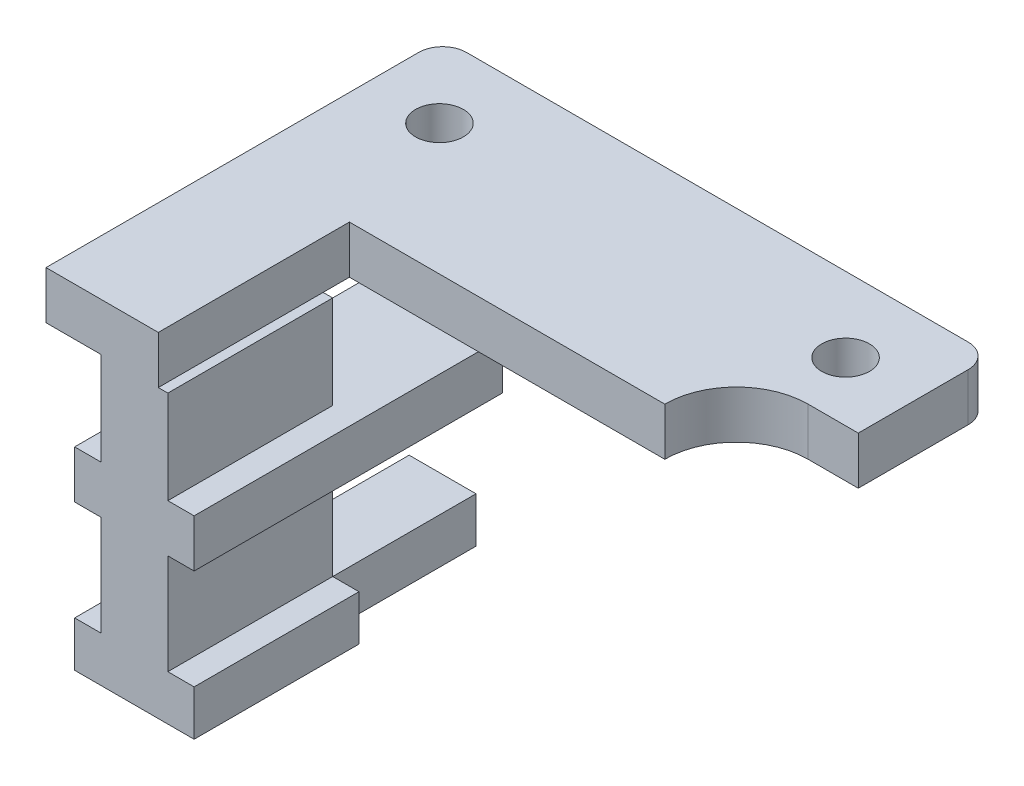
ISO-10303-21;
HEADER;
FILE_DESCRIPTION(('STEP AP214'),'2;1');
FILE_NAME('part.step','',(''),(''),'','','');
FILE_SCHEMA(('AUTOMOTIVE_DESIGN { 1 0 10303 214 1 1 1 1 }'));
ENDSEC;
DATA;
#1=APPLICATION_CONTEXT('core data for automotive mechanical design processes');
#2=APPLICATION_PROTOCOL_DEFINITION('international standard','automotive_design',2000,#1);
#3=PRODUCT_CONTEXT('',#1,'mechanical');
#4=PRODUCT('Part','Part','',(#3));
#5=PRODUCT_RELATED_PRODUCT_CATEGORY('part','',(#4));
#6=PRODUCT_DEFINITION_FORMATION('','',#4);
#7=PRODUCT_DEFINITION_CONTEXT('part definition',#1,'design');
#8=PRODUCT_DEFINITION('design','',#6,#7);
#9=PRODUCT_DEFINITION_SHAPE('','',#8);
#10=(LENGTH_UNIT() NAMED_UNIT(*) SI_UNIT(.MILLI.,.METRE.));
#11=(NAMED_UNIT(*) PLANE_ANGLE_UNIT() SI_UNIT($,.RADIAN.));
#12=(NAMED_UNIT(*) SI_UNIT($,.STERADIAN.) SOLID_ANGLE_UNIT());
#13=UNCERTAINTY_MEASURE_WITH_UNIT(LENGTH_MEASURE(1.E-05),#10,'distance_accuracy_value','');
#14=(GEOMETRIC_REPRESENTATION_CONTEXT(3) GLOBAL_UNCERTAINTY_ASSIGNED_CONTEXT((#13)) GLOBAL_UNIT_ASSIGNED_CONTEXT((#10,
#11,#12)) REPRESENTATION_CONTEXT('',''));
#15=CARTESIAN_POINT('',(0.,0.,0.));
#16=DIRECTION('',(0.,0.,1.));
#17=DIRECTION('',(1.,0.,0.));
#18=AXIS2_PLACEMENT_3D('',#15,#16,#17);
#19=CARTESIAN_POINT('',(0.,0.,1.1));
#20=DIRECTION('',(0.,0.,1.));
#21=DIRECTION('',(1.,0.,0.));
#22=AXIS2_PLACEMENT_3D('',#19,#20,#21);
#23=PLANE('',#22);
#24=DIRECTION('',(0.,1.,0.));
#25=VECTOR('',#24,1.);
#26=CARTESIAN_POINT('',(-6.2,2.,1.1));
#27=LINE('',#26,#25);
#28=CARTESIAN_POINT('',(-6.2,-3.9,1.1));
#29=VERTEX_POINT('',#28);
#30=CARTESIAN_POINT('',(-6.2,0.,1.1));
#31=VERTEX_POINT('',#30);
#32=EDGE_CURVE('E350',#29,#31,#27,.T.);
#33=ORIENTED_EDGE('',*,*,#32,.F.);
#34=DIRECTION('',(-1.,0.,0.));
#35=VECTOR('',#34,1.);
#36=CARTESIAN_POINT('',(0.,-3.9,1.1));
#37=LINE('',#36,#35);
#38=CARTESIAN_POINT('',(-9.00000000000001,-3.9,1.1));
#39=VERTEX_POINT('',#38);
#40=EDGE_CURVE('E296',#29,#39,#37,.T.);
#41=ORIENTED_EDGE('',*,*,#40,.T.);
#42=DIRECTION('',(0.,-1.,0.));
#43=VECTOR('',#42,1.);
#44=CARTESIAN_POINT('',(-9.00000000000001,2.,1.1));
#45=LINE('',#44,#43);
#46=CARTESIAN_POINT('',(-9.00000000000001,0.,1.1));
#47=VERTEX_POINT('',#46);
#48=EDGE_CURVE('E361',#47,#39,#45,.T.);
#49=ORIENTED_EDGE('',*,*,#48,.F.);
#50=DIRECTION('',(-1.,0.,0.));
#51=VECTOR('',#50,1.);
#52=CARTESIAN_POINT('',(-6.6,0.,1.1));
#53=LINE('',#52,#51);
#54=CARTESIAN_POINT('',(-6.6,0.,1.1));
#55=VERTEX_POINT('',#54);
#56=EDGE_CURVE('E360',#55,#47,#53,.T.);
#57=ORIENTED_EDGE('',*,*,#56,.F.);
#58=EDGE_CURVE('E355',#31,#55,#53,.T.);
#59=ORIENTED_EDGE('',*,*,#58,.F.);
#60=EDGE_LOOP('',(#33,#41,#49,#57,#59));
#61=FACE_BOUND('',#60,.T.);
#62=ADVANCED_FACE('F39',(#61),#23,.F.);
#63=CARTESIAN_POINT('',(-9.00000000000001,2.,1.1));
#64=DIRECTION('',(-1.,0.,0.));
#65=DIRECTION('',(0.,0.,1.));
#66=AXIS2_PLACEMENT_3D('',#63,#64,#65);
#67=PLANE('',#66);
#68=DIRECTION('',(0.,0.,-1.));
#69=VECTOR('',#68,1.);
#70=CARTESIAN_POINT('',(-9.00000000000001,-3.9,1.1));
#71=LINE('',#70,#69);
#72=CARTESIAN_POINT('',(-9.00000000000001,-3.9,8.));
#73=VERTEX_POINT('',#72);
#74=EDGE_CURVE('E300',#73,#39,#71,.T.);
#75=ORIENTED_EDGE('',*,*,#74,.F.);
#76=DIRECTION('',(0.,-1.,0.));
#77=VECTOR('',#76,1.);
#78=CARTESIAN_POINT('',(-9.00000000000001,2.,8.));
#79=LINE('',#78,#77);
#80=CARTESIAN_POINT('',(-9.00000000000001,0.,8.));
#81=VERTEX_POINT('',#80);
#82=EDGE_CURVE('E394',#81,#73,#79,.T.);
#83=ORIENTED_EDGE('',*,*,#82,.F.);
#84=DIRECTION('',(0.,0.,1.));
#85=VECTOR('',#84,1.);
#86=CARTESIAN_POINT('',(-9.00000000000001,0.,1.1));
#87=LINE('',#86,#85);
#88=EDGE_CURVE('E409',#47,#81,#87,.T.);
#89=ORIENTED_EDGE('',*,*,#88,.F.);
#90=ORIENTED_EDGE('',*,*,#48,.T.);
#91=EDGE_LOOP('',(#75,#83,#89,#90));
#92=FACE_BOUND('',#91,.T.);
#93=ADVANCED_FACE('F625',(#92),#67,.T.);
#94=CARTESIAN_POINT('',(-6.2,2.,1.1));
#95=DIRECTION('',(1.,0.,0.));
#96=DIRECTION('',(0.,0.,-1.));
#97=AXIS2_PLACEMENT_3D('',#94,#95,#96);
#98=PLANE('',#97);
#99=DIRECTION('',(0.,0.,1.));
#100=VECTOR('',#99,1.);
#101=CARTESIAN_POINT('',(-6.2,-3.9,1.1));
#102=LINE('',#101,#100);
#103=CARTESIAN_POINT('',(-6.2,-3.9,8.));
#104=VERTEX_POINT('',#103);
#105=EDGE_CURVE('E11',#29,#104,#102,.T.);
#106=ORIENTED_EDGE('',*,*,#105,.F.);
#107=ORIENTED_EDGE('',*,*,#32,.T.);
#108=DIRECTION('',(0.,0.,1.));
#109=VECTOR('',#108,1.);
#110=CARTESIAN_POINT('',(-6.2,0.,1.1));
#111=LINE('',#110,#109);
#112=CARTESIAN_POINT('',(-6.2,0.,8.));
#113=VERTEX_POINT('',#112);
#114=EDGE_CURVE('E413',#31,#113,#111,.T.);
#115=ORIENTED_EDGE('',*,*,#114,.T.);
#116=DIRECTION('',(0.,1.,0.));
#117=VECTOR('',#116,1.);
#118=CARTESIAN_POINT('',(-6.2,2.,8.));
#119=LINE('',#118,#117);
#120=EDGE_CURVE('E384',#104,#113,#119,.T.);
#121=ORIENTED_EDGE('',*,*,#120,.F.);
#122=EDGE_LOOP('',(#106,#107,#115,#121));
#123=FACE_BOUND('',#122,.T.);
#124=ADVANCED_FACE('F595',(#123),#98,.T.);
#125=DIRECTION('',(-1.,0.,0.));
#126=VECTOR('',#125,1.);
#127=CARTESIAN_POINT('',(-6.6,-10.1,1.1));
#128=LINE('',#127,#126);
#129=CARTESIAN_POINT('',(-9.00000000000001,-10.1,1.09999999999999));
#130=VERTEX_POINT('',#129);
#131=CARTESIAN_POINT('',(-10.1,-10.1,1.1));
#132=VERTEX_POINT('',#131);
#133=EDGE_CURVE('E365',#130,#132,#128,.T.);
#134=ORIENTED_EDGE('',*,*,#133,.F.);
#135=DIRECTION('',(0.,-1.,0.));
#136=VECTOR('',#135,1.);
#137=CARTESIAN_POINT('',(-9.00000000000001,0.,1.1));
#138=LINE('',#137,#136);
#139=CARTESIAN_POINT('',(-9.00000000000001,-12.,1.09999999999999));
#140=VERTEX_POINT('',#139);
#141=EDGE_CURVE('E557',#130,#140,#138,.T.);
#142=ORIENTED_EDGE('',*,*,#141,.T.);
#143=DIRECTION('',(1.,0.,0.));
#144=VECTOR('',#143,1.);
#145=CARTESIAN_POINT('',(-6.6,-12.,1.1));
#146=LINE('',#145,#144);
#147=CARTESIAN_POINT('',(-10.1,-12.,1.1));
#148=VERTEX_POINT('',#147);
#149=EDGE_CURVE('E338',#148,#140,#146,.T.);
#150=ORIENTED_EDGE('',*,*,#149,.F.);
#151=DIRECTION('',(0.,-1.,0.));
#152=VECTOR('',#151,1.);
#153=CARTESIAN_POINT('',(-10.1,2.,1.1));
#154=LINE('',#153,#152);
#155=EDGE_CURVE('E332',#132,#148,#154,.T.);
#156=ORIENTED_EDGE('',*,*,#155,.F.);
#157=EDGE_LOOP('',(#134,#142,#150,#156));
#158=FACE_BOUND('',#157,.T.);
#159=ADVANCED_FACE('F672',(#158),#23,.F.);
#160=CARTESIAN_POINT('',(-9.00000000000001,-5.9,1.1));
#161=VERTEX_POINT('',#160);
#162=EDGE_CURVE('E359',#161,#130,#45,.T.);
#163=ORIENTED_EDGE('',*,*,#162,.F.);
#164=DIRECTION('',(1.,0.,0.));
#165=VECTOR('',#164,1.);
#166=CARTESIAN_POINT('',(0.,-5.9,1.1));
#167=LINE('',#166,#165);
#168=CARTESIAN_POINT('',(-6.2,-5.9,1.1));
#169=VERTEX_POINT('',#168);
#170=EDGE_CURVE('E284',#161,#169,#167,.T.);
#171=ORIENTED_EDGE('',*,*,#170,.T.);
#172=CARTESIAN_POINT('',(-6.2,-10.1,1.09999999999999));
#173=VERTEX_POINT('',#172);
#174=EDGE_CURVE('E351',#173,#169,#27,.T.);
#175=ORIENTED_EDGE('',*,*,#174,.F.);
#176=DIRECTION('',(-1.,0.,0.));
#177=VECTOR('',#176,1.);
#178=CARTESIAN_POINT('',(0.,-10.1,1.1));
#179=LINE('',#178,#177);
#180=EDGE_CURVE('E553',#173,#130,#179,.T.);
#181=ORIENTED_EDGE('',*,*,#180,.T.);
#182=EDGE_LOOP('',(#163,#171,#175,#181));
#183=FACE_BOUND('',#182,.T.);
#184=ADVANCED_FACE('F568',(#183),#23,.F.);
#185=CARTESIAN_POINT('',(9.6,2.,0.));
#186=DIRECTION('',(0.,1.,0.));
#187=DIRECTION('',(0.,0.,1.));
#188=AXIS2_PLACEMENT_3D('',#185,#186,#187);
#189=PLANE('',#188);
#190=CARTESIAN_POINT('',(-8.3,2.,-5.46956521739131));
#191=DIRECTION('',(0.,1.,0.));
#192=DIRECTION('',(0.,0.,1.));
#193=AXIS2_PLACEMENT_3D('',#190,#191,#192);
#194=CIRCLE('',#193,1.);
#195=CARTESIAN_POINT('',(-8.3,2.,-4.46956521739131));
#196=VERTEX_POINT('',#195);
#197=EDGE_CURVE('E437',#196,#196,#194,.T.);
#198=ORIENTED_EDGE('',*,*,#197,.F.);
#199=EDGE_LOOP('',(#198));
#200=FACE_BOUND('',#199,.T.);
#201=DIRECTION('',(1.,0.,0.));
#202=VECTOR('',#201,1.);
#203=CARTESIAN_POINT('',(11.7,2.,-3.));
#204=LINE('',#203,#202);
#205=CARTESIAN_POINT('',(9.6,2.,-3.));
#206=VERTEX_POINT('',#205);
#207=CARTESIAN_POINT('',(11.7,2.,-3.));
#208=VERTEX_POINT('',#207);
#209=EDGE_CURVE('E445',#206,#208,#204,.T.);
#210=ORIENTED_EDGE('',*,*,#209,.T.);
#211=DIRECTION('',(0.,0.,-1.));
#212=VECTOR('',#211,1.);
#213=CARTESIAN_POINT('',(11.7,2.,-3.));
#214=LINE('',#213,#212);
#215=CARTESIAN_POINT('',(11.7,2.,-7.6));
#216=VERTEX_POINT('',#215);
#217=EDGE_CURVE('E449',#208,#216,#214,.T.);
#218=ORIENTED_EDGE('',*,*,#217,.T.);
#219=CARTESIAN_POINT('',(10.7,2.,-7.6));
#220=DIRECTION('',(0.,1.,0.));
#221=DIRECTION('',(0.,0.,1.));
#222=AXIS2_PLACEMENT_3D('',#219,#220,#221);
#223=CIRCLE('',#222,1.);
#224=CARTESIAN_POINT('',(10.7,2.,-8.6));
#225=VERTEX_POINT('',#224);
#226=EDGE_CURVE('E453',#216,#225,#223,.T.);
#227=ORIENTED_EDGE('',*,*,#226,.T.);
#228=DIRECTION('',(-1.,0.,0.));
#229=VECTOR('',#228,1.);
#230=CARTESIAN_POINT('',(10.7,2.,-8.6));
#231=LINE('',#230,#229);
#232=CARTESIAN_POINT('',(-10.3,2.,-8.6));
#233=VERTEX_POINT('',#232);
#234=EDGE_CURVE('E456',#225,#233,#231,.T.);
#235=ORIENTED_EDGE('',*,*,#234,.T.);
#236=CARTESIAN_POINT('',(-10.3,2.,-7.6));
#237=DIRECTION('',(0.,1.,0.));
#238=DIRECTION('',(0.,0.,1.));
#239=AXIS2_PLACEMENT_3D('',#236,#237,#238);
#240=CIRCLE('',#239,0.999999999999999);
#241=CARTESIAN_POINT('',(-11.3,2.,-7.6));
#242=VERTEX_POINT('',#241);
#243=EDGE_CURVE('E459',#233,#242,#240,.T.);
#244=ORIENTED_EDGE('',*,*,#243,.T.);
#245=DIRECTION('',(0.,0.,1.));
#246=VECTOR('',#245,1.);
#247=CARTESIAN_POINT('',(-11.3,2.,8.));
#248=LINE('',#247,#246);
#249=CARTESIAN_POINT('',(-11.3,2.,8.));
#250=VERTEX_POINT('',#249);
#251=EDGE_CURVE('E462',#242,#250,#248,.T.);
#252=ORIENTED_EDGE('',*,*,#251,.T.);
#253=DIRECTION('',(1.,0.,0.));
#254=VECTOR('',#253,1.);
#255=CARTESIAN_POINT('',(-6.6,2.,8.));
#256=LINE('',#255,#254);
#257=CARTESIAN_POINT('',(-6.6,2.,8.));
#258=VERTEX_POINT('',#257);
#259=EDGE_CURVE('E465',#250,#258,#256,.T.);
#260=ORIENTED_EDGE('',*,*,#259,.T.);
#261=DIRECTION('',(0.,0.,-1.));
#262=VECTOR('',#261,1.);
#263=CARTESIAN_POINT('',(-6.6,2.,0.));
#264=LINE('',#263,#262);
#265=CARTESIAN_POINT('',(-6.6,2.,0.));
#266=VERTEX_POINT('',#265);
#267=EDGE_CURVE('E468',#258,#266,#264,.T.);
#268=ORIENTED_EDGE('',*,*,#267,.T.);
#269=DIRECTION('',(1.,0.,0.));
#270=VECTOR('',#269,1.);
#271=CARTESIAN_POINT('',(-6.6,2.,0.));
#272=LINE('',#271,#270);
#273=CARTESIAN_POINT('',(6.6,2.,0.));
#274=VERTEX_POINT('',#273);
#275=EDGE_CURVE('E471',#266,#274,#272,.T.);
#276=ORIENTED_EDGE('',*,*,#275,.T.);
#277=CARTESIAN_POINT('',(9.6,2.,0.));
#278=DIRECTION('',(0.,-1.,0.));
#279=DIRECTION('',(0.,0.,1.));
#280=AXIS2_PLACEMENT_3D('',#277,#278,#279);
#281=CIRCLE('',#280,3.);
#282=EDGE_CURVE('E474',#274,#206,#281,.T.);
#283=ORIENTED_EDGE('',*,*,#282,.T.);
#284=EDGE_LOOP('',(#210,#218,#227,#235,#244,#252,#260,#268,#276,#283));
#285=FACE_BOUND('',#284,.T.);
#286=CARTESIAN_POINT('',(8.7,2.,-5.46956521739131));
#287=DIRECTION('',(0.,1.,0.));
#288=DIRECTION('',(0.,0.,1.));
#289=AXIS2_PLACEMENT_3D('',#286,#287,#288);
#290=CIRCLE('',#289,1.);
#291=CARTESIAN_POINT('',(8.7,2.,-4.46956521739131));
#292=VERTEX_POINT('',#291);
#293=EDGE_CURVE('E429',#292,#292,#290,.T.);
#294=ORIENTED_EDGE('',*,*,#293,.F.);
#295=EDGE_LOOP('',(#294));
#296=FACE_BOUND('',#295,.T.);
#297=ADVANCED_FACE('F609',(#200,#285,#296),#189,.T.);
#298=CARTESIAN_POINT('',(9.6,0.,0.));
#299=DIRECTION('',(0.,1.,0.));
#300=DIRECTION('',(0.,0.,1.));
#301=AXIS2_PLACEMENT_3D('',#298,#299,#300);
#302=PLANE('',#301);
#303=DIRECTION('',(0.,0.,-1.));
#304=VECTOR('',#303,1.);
#305=CARTESIAN_POINT('',(-6.6,0.,0.));
#306=LINE('',#305,#304);
#307=CARTESIAN_POINT('',(-6.6,0.,0.));
#308=VERTEX_POINT('',#307);
#309=EDGE_CURVE('E500',#55,#308,#306,.T.);
#310=ORIENTED_EDGE('',*,*,#309,.F.);
#311=ORIENTED_EDGE('',*,*,#56,.T.);
#312=ORIENTED_EDGE('',*,*,#88,.T.);
#313=DIRECTION('',(1.,0.,0.));
#314=VECTOR('',#313,1.);
#315=CARTESIAN_POINT('',(-6.6,0.,8.));
#316=LINE('',#315,#314);
#317=CARTESIAN_POINT('',(-11.3,0.,8.));
#318=VERTEX_POINT('',#317);
#319=EDGE_CURVE('E496',#318,#81,#316,.T.);
#320=ORIENTED_EDGE('',*,*,#319,.F.);
#321=DIRECTION('',(0.,0.,1.));
#322=VECTOR('',#321,1.);
#323=CARTESIAN_POINT('',(-11.3,0.,8.));
#324=LINE('',#323,#322);
#325=CARTESIAN_POINT('',(-11.3,0.,-7.6));
#326=VERTEX_POINT('',#325);
#327=EDGE_CURVE('E493',#326,#318,#324,.T.);
#328=ORIENTED_EDGE('',*,*,#327,.F.);
#329=CARTESIAN_POINT('',(-10.3,0.,-7.6));
#330=DIRECTION('',(0.,1.,0.));
#331=DIRECTION('',(0.,0.,1.));
#332=AXIS2_PLACEMENT_3D('',#329,#330,#331);
#333=CIRCLE('',#332,0.999999999999999);
#334=CARTESIAN_POINT('',(-10.3,0.,-8.6));
#335=VERTEX_POINT('',#334);
#336=EDGE_CURVE('E490',#335,#326,#333,.T.);
#337=ORIENTED_EDGE('',*,*,#336,.F.);
#338=DIRECTION('',(-1.,0.,0.));
#339=VECTOR('',#338,1.);
#340=CARTESIAN_POINT('',(10.7,0.,-8.6));
#341=LINE('',#340,#339);
#342=CARTESIAN_POINT('',(10.7,0.,-8.6));
#343=VERTEX_POINT('',#342);
#344=EDGE_CURVE('E487',#343,#335,#341,.T.);
#345=ORIENTED_EDGE('',*,*,#344,.F.);
#346=CARTESIAN_POINT('',(10.7,0.,-7.6));
#347=DIRECTION('',(0.,1.,0.));
#348=DIRECTION('',(0.,0.,1.));
#349=AXIS2_PLACEMENT_3D('',#346,#347,#348);
#350=CIRCLE('',#349,1.);
#351=CARTESIAN_POINT('',(11.7,0.,-7.6));
#352=VERTEX_POINT('',#351);
#353=EDGE_CURVE('E484',#352,#343,#350,.T.);
#354=ORIENTED_EDGE('',*,*,#353,.F.);
#355=DIRECTION('',(0.,0.,-1.));
#356=VECTOR('',#355,1.);
#357=CARTESIAN_POINT('',(11.7,0.,-3.));
#358=LINE('',#357,#356);
#359=CARTESIAN_POINT('',(11.7,0.,-3.));
#360=VERTEX_POINT('',#359);
#361=EDGE_CURVE('E481',#360,#352,#358,.T.);
#362=ORIENTED_EDGE('',*,*,#361,.F.);
#363=DIRECTION('',(1.,0.,0.));
#364=VECTOR('',#363,1.);
#365=CARTESIAN_POINT('',(11.7,0.,-3.));
#366=LINE('',#365,#364);
#367=CARTESIAN_POINT('',(9.6,0.,-3.));
#368=VERTEX_POINT('',#367);
#369=EDGE_CURVE('E441',#368,#360,#366,.T.);
#370=ORIENTED_EDGE('',*,*,#369,.F.);
#371=CARTESIAN_POINT('',(9.6,0.,0.));
#372=DIRECTION('',(0.,-1.,0.));
#373=DIRECTION('',(0.,0.,1.));
#374=AXIS2_PLACEMENT_3D('',#371,#372,#373);
#375=CIRCLE('',#374,3.);
#376=CARTESIAN_POINT('',(6.6,0.,0.));
#377=VERTEX_POINT('',#376);
#378=EDGE_CURVE('E450',#377,#368,#375,.T.);
#379=ORIENTED_EDGE('',*,*,#378,.F.);
#380=DIRECTION('',(1.,0.,0.));
#381=VECTOR('',#380,1.);
#382=CARTESIAN_POINT('',(-6.6,0.,0.));
#383=LINE('',#382,#381);
#384=EDGE_CURVE('E505',#308,#377,#383,.T.);
#385=ORIENTED_EDGE('',*,*,#384,.F.);
#386=EDGE_LOOP('',(#310,#311,#312,#320,#328,#337,#345,#354,#362,#370,#379,#385));
#387=FACE_BOUND('',#386,.T.);
#388=CARTESIAN_POINT('',(-8.3,0.,-5.46956521739131));
#389=DIRECTION('',(0.,1.,0.));
#390=DIRECTION('',(0.,0.,1.));
#391=AXIS2_PLACEMENT_3D('',#388,#389,#390);
#392=CIRCLE('',#391,1.);
#393=CARTESIAN_POINT('',(-8.3,0.,-4.46956521739131));
#394=VERTEX_POINT('',#393);
#395=EDGE_CURVE('E433',#394,#394,#392,.T.);
#396=ORIENTED_EDGE('',*,*,#395,.T.);
#397=EDGE_LOOP('',(#396));
#398=FACE_BOUND('',#397,.T.);
#399=CARTESIAN_POINT('',(8.7,0.,-5.46956521739131));
#400=DIRECTION('',(0.,1.,0.));
#401=DIRECTION('',(0.,0.,1.));
#402=AXIS2_PLACEMENT_3D('',#399,#400,#401);
#403=CIRCLE('',#402,1.);
#404=CARTESIAN_POINT('',(8.7,0.,-4.46956521739131));
#405=VERTEX_POINT('',#404);
#406=EDGE_CURVE('E404',#405,#405,#403,.T.);
#407=ORIENTED_EDGE('',*,*,#406,.T.);
#408=EDGE_LOOP('',(#407));
#409=FACE_BOUND('',#408,.T.);
#410=ADVANCED_FACE('F619',(#387,#398,#409),#302,.F.);
#411=CARTESIAN_POINT('',(11.7,2.,-3.));
#412=DIRECTION('',(0.,0.,-1.));
#413=DIRECTION('',(-1.,0.,0.));
#414=AXIS2_PLACEMENT_3D('',#411,#412,#413);
#415=PLANE('',#414);
#416=ORIENTED_EDGE('',*,*,#369,.T.);
#417=DIRECTION('',(0.,-1.,0.));
#418=VECTOR('',#417,1.);
#419=CARTESIAN_POINT('',(11.7,2.,-3.));
#420=LINE('',#419,#418);
#421=EDGE_CURVE('E545',#208,#360,#420,.T.);
#422=ORIENTED_EDGE('',*,*,#421,.F.);
#423=ORIENTED_EDGE('',*,*,#209,.F.);
#424=DIRECTION('',(0.,-1.,0.));
#425=VECTOR('',#424,1.);
#426=CARTESIAN_POINT('',(9.6,2.,-3.));
#427=LINE('',#426,#425);
#428=EDGE_CURVE('E477',#206,#368,#427,.T.);
#429=ORIENTED_EDGE('',*,*,#428,.T.);
#430=EDGE_LOOP('',(#416,#422,#423,#429));
#431=FACE_BOUND('',#430,.T.);
#432=ADVANCED_FACE('F41',(#431),#415,.F.);
#433=CARTESIAN_POINT('',(11.7,2.,-3.));
#434=DIRECTION('',(-1.,0.,0.));
#435=DIRECTION('',(0.,0.,1.));
#436=AXIS2_PLACEMENT_3D('',#433,#434,#435);
#437=PLANE('',#436);
#438=ORIENTED_EDGE('',*,*,#361,.T.);
#439=DIRECTION('',(0.,-1.,0.));
#440=VECTOR('',#439,1.);
#441=CARTESIAN_POINT('',(11.7,2.,-7.6));
#442=LINE('',#441,#440);
#443=EDGE_CURVE('E541',#216,#352,#442,.T.);
#444=ORIENTED_EDGE('',*,*,#443,.F.);
#445=ORIENTED_EDGE('',*,*,#217,.F.);
#446=ORIENTED_EDGE('',*,*,#421,.T.);
#447=EDGE_LOOP('',(#438,#444,#445,#446));
#448=FACE_BOUND('',#447,.T.);
#449=ADVANCED_FACE('F650',(#448),#437,.F.);
#450=CARTESIAN_POINT('',(10.7,2.,-7.6));
#451=DIRECTION('',(0.,-1.,0.));
#452=DIRECTION('',(0.,0.,-1.));
#453=AXIS2_PLACEMENT_3D('',#450,#451,#452);
#454=CYLINDRICAL_SURFACE('',#453,1.);
#455=ORIENTED_EDGE('',*,*,#353,.T.);
#456=DIRECTION('',(0.,-1.,0.));
#457=VECTOR('',#456,1.);
#458=CARTESIAN_POINT('',(10.7,2.,-8.6));
#459=LINE('',#458,#457);
#460=EDGE_CURVE('E537',#225,#343,#459,.T.);
#461=ORIENTED_EDGE('',*,*,#460,.F.);
#462=ORIENTED_EDGE('',*,*,#226,.F.);
#463=ORIENTED_EDGE('',*,*,#443,.T.);
#464=EDGE_LOOP('',(#455,#461,#462,#463));
#465=FACE_BOUND('',#464,.T.);
#466=ADVANCED_FACE('F655',(#465),#454,.T.);
#467=CARTESIAN_POINT('',(10.7,2.,-8.6));
#468=DIRECTION('',(0.,0.,1.));
#469=DIRECTION('',(1.,0.,0.));
#470=AXIS2_PLACEMENT_3D('',#467,#468,#469);
#471=PLANE('',#470);
#472=ORIENTED_EDGE('',*,*,#344,.T.);
#473=DIRECTION('',(0.,-1.,0.));
#474=VECTOR('',#473,1.);
#475=CARTESIAN_POINT('',(-10.3,2.,-8.6));
#476=LINE('',#475,#474);
#477=EDGE_CURVE('E533',#233,#335,#476,.T.);
#478=ORIENTED_EDGE('',*,*,#477,.F.);
#479=ORIENTED_EDGE('',*,*,#234,.F.);
#480=ORIENTED_EDGE('',*,*,#460,.T.);
#481=EDGE_LOOP('',(#472,#478,#479,#480));
#482=FACE_BOUND('',#481,.T.);
#483=ADVANCED_FACE('F659',(#482),#471,.F.);
#484=CARTESIAN_POINT('',(-10.3,2.,-7.6));
#485=DIRECTION('',(0.,-1.,0.));
#486=DIRECTION('',(0.,0.,-1.));
#487=AXIS2_PLACEMENT_3D('',#484,#485,#486);
#488=CYLINDRICAL_SURFACE('',#487,0.999999999999999);
#489=ORIENTED_EDGE('',*,*,#336,.T.);
#490=DIRECTION('',(0.,-1.,0.));
#491=VECTOR('',#490,1.);
#492=CARTESIAN_POINT('',(-11.3,2.,-7.6));
#493=LINE('',#492,#491);
#494=EDGE_CURVE('E529',#242,#326,#493,.T.);
#495=ORIENTED_EDGE('',*,*,#494,.F.);
#496=ORIENTED_EDGE('',*,*,#243,.F.);
#497=ORIENTED_EDGE('',*,*,#477,.T.);
#498=EDGE_LOOP('',(#489,#495,#496,#497));
#499=FACE_BOUND('',#498,.T.);
#500=ADVANCED_FACE('F661',(#499),#488,.T.);
#501=CARTESIAN_POINT('',(-11.3,2.,8.));
#502=DIRECTION('',(1.,0.,0.));
#503=DIRECTION('',(0.,0.,-1.));
#504=AXIS2_PLACEMENT_3D('',#501,#502,#503);
#505=PLANE('',#504);
#506=ORIENTED_EDGE('',*,*,#327,.T.);
#507=DIRECTION('',(0.,-1.,0.));
#508=VECTOR('',#507,1.);
#509=CARTESIAN_POINT('',(-11.3,2.,8.));
#510=LINE('',#509,#508);
#511=EDGE_CURVE('E525',#250,#318,#510,.T.);
#512=ORIENTED_EDGE('',*,*,#511,.F.);
#513=ORIENTED_EDGE('',*,*,#251,.F.);
#514=ORIENTED_EDGE('',*,*,#494,.T.);
#515=EDGE_LOOP('',(#506,#512,#513,#514));
#516=FACE_BOUND('',#515,.T.);
#517=ADVANCED_FACE('F615',(#516),#505,.F.);
#518=CARTESIAN_POINT('',(-6.6,2.,8.));
#519=DIRECTION('',(0.,0.,-1.));
#520=DIRECTION('',(-1.,0.,0.));
#521=AXIS2_PLACEMENT_3D('',#518,#519,#520);
#522=PLANE('',#521);
#523=CARTESIAN_POINT('',(-6.2,-10.1,8.));
#524=VERTEX_POINT('',#523);
#525=CARTESIAN_POINT('',(-6.2,-5.9,8.));
#526=VERTEX_POINT('',#525);
#527=EDGE_CURVE('E385',#524,#526,#119,.T.);
#528=ORIENTED_EDGE('',*,*,#527,.T.);
#529=DIRECTION('',(1.,0.,0.));
#530=VECTOR('',#529,1.);
#531=CARTESIAN_POINT('',(-5.1,-5.9,8.));
#532=LINE('',#531,#530);
#533=CARTESIAN_POINT('',(-5.1,-5.9,8.));
#534=VERTEX_POINT('',#533);
#535=EDGE_CURVE('E276',#526,#534,#532,.T.);
#536=ORIENTED_EDGE('',*,*,#535,.T.);
#537=DIRECTION('',(0.,1.,0.));
#538=VECTOR('',#537,1.);
#539=CARTESIAN_POINT('',(-5.1,-5.9,8.));
#540=LINE('',#539,#538);
#541=CARTESIAN_POINT('',(-5.1,-3.9,8.));
#542=VERTEX_POINT('',#541);
#543=EDGE_CURVE('E279',#534,#542,#540,.T.);
#544=ORIENTED_EDGE('',*,*,#543,.T.);
#545=DIRECTION('',(-1.,0.,0.));
#546=VECTOR('',#545,1.);
#547=CARTESIAN_POINT('',(-5.1,-3.9,8.));
#548=LINE('',#547,#546);
#549=EDGE_CURVE('E55',#542,#104,#548,.T.);
#550=ORIENTED_EDGE('',*,*,#549,.T.);
#551=ORIENTED_EDGE('',*,*,#120,.T.);
#552=DIRECTION('',(-1.,0.,0.));
#553=VECTOR('',#552,1.);
#554=CARTESIAN_POINT('',(-6.6,0.,8.));
#555=LINE('',#554,#553);
#556=CARTESIAN_POINT('',(-6.6,0.,8.));
#557=VERTEX_POINT('',#556);
#558=EDGE_CURVE('E389',#113,#557,#555,.T.);
#559=ORIENTED_EDGE('',*,*,#558,.T.);
#560=DIRECTION('',(0.,-1.,0.));
#561=VECTOR('',#560,1.);
#562=CARTESIAN_POINT('',(-6.6,2.,8.));
#563=LINE('',#562,#561);
#564=EDGE_CURVE('E521',#258,#557,#563,.T.);
#565=ORIENTED_EDGE('',*,*,#564,.F.);
#566=ORIENTED_EDGE('',*,*,#259,.F.);
#567=ORIENTED_EDGE('',*,*,#511,.T.);
#568=ORIENTED_EDGE('',*,*,#319,.T.);
#569=ORIENTED_EDGE('',*,*,#82,.T.);
#570=CARTESIAN_POINT('',(-10.1,-3.9,8.));
#571=VERTEX_POINT('',#570);
#572=EDGE_CURVE('E266',#73,#571,#548,.T.);
#573=ORIENTED_EDGE('',*,*,#572,.T.);
#574=DIRECTION('',(0.,-1.,0.));
#575=VECTOR('',#574,1.);
#576=CARTESIAN_POINT('',(-10.1,-5.9,8.));
#577=LINE('',#576,#575);
#578=CARTESIAN_POINT('',(-10.1,-5.9,8.));
#579=VERTEX_POINT('',#578);
#580=EDGE_CURVE('E273',#571,#579,#577,.T.);
#581=ORIENTED_EDGE('',*,*,#580,.T.);
#582=CARTESIAN_POINT('',(-9.00000000000001,-5.9,8.));
#583=VERTEX_POINT('',#582);
#584=EDGE_CURVE('E240',#579,#583,#532,.T.);
#585=ORIENTED_EDGE('',*,*,#584,.T.);
#586=CARTESIAN_POINT('',(-9.00000000000001,-10.1,8.));
#587=VERTEX_POINT('',#586);
#588=EDGE_CURVE('E393',#583,#587,#79,.T.);
#589=ORIENTED_EDGE('',*,*,#588,.T.);
#590=DIRECTION('',(-1.,0.,0.));
#591=VECTOR('',#590,1.);
#592=CARTESIAN_POINT('',(-6.6,-10.1,8.));
#593=LINE('',#592,#591);
#594=CARTESIAN_POINT('',(-10.1,-10.1,8.));
#595=VERTEX_POINT('',#594);
#596=EDGE_CURVE('E337',#587,#595,#593,.T.);
#597=ORIENTED_EDGE('',*,*,#596,.T.);
#598=DIRECTION('',(0.,-1.,0.));
#599=VECTOR('',#598,1.);
#600=CARTESIAN_POINT('',(-10.1,2.,8.));
#601=LINE('',#600,#599);
#602=CARTESIAN_POINT('',(-10.1,-12.,8.));
#603=VERTEX_POINT('',#602);
#604=EDGE_CURVE('E323',#595,#603,#601,.T.);
#605=ORIENTED_EDGE('',*,*,#604,.T.);
#606=DIRECTION('',(1.,0.,0.));
#607=VECTOR('',#606,1.);
#608=CARTESIAN_POINT('',(-6.6,-12.,8.));
#609=LINE('',#608,#607);
#610=CARTESIAN_POINT('',(-5.1,-12.,8.));
#611=VERTEX_POINT('',#610);
#612=EDGE_CURVE('E373',#603,#611,#609,.T.);
#613=ORIENTED_EDGE('',*,*,#612,.T.);
#614=DIRECTION('',(0.,1.,0.));
#615=VECTOR('',#614,1.);
#616=CARTESIAN_POINT('',(-5.1,2.,8.));
#617=LINE('',#616,#615);
#618=CARTESIAN_POINT('',(-5.1,-10.1,8.));
#619=VERTEX_POINT('',#618);
#620=EDGE_CURVE('E376',#611,#619,#617,.T.);
#621=ORIENTED_EDGE('',*,*,#620,.T.);
#622=DIRECTION('',(-1.,0.,0.));
#623=VECTOR('',#622,1.);
#624=CARTESIAN_POINT('',(-6.6,-10.1,8.));
#625=LINE('',#624,#623);
#626=EDGE_CURVE('E380',#619,#524,#625,.T.);
#627=ORIENTED_EDGE('',*,*,#626,.T.);
#628=EDGE_LOOP('',(#528,#536,#544,#550,#551,#559,#565,#566,#567,#568,#569,#573,#581,#585,#589,
#597,#605,#613,#621,#627));
#629=FACE_BOUND('',#628,.T.);
#630=ADVANCED_FACE('F589',(#629),#522,.F.);
#631=CARTESIAN_POINT('',(-6.6,2.,0.));
#632=DIRECTION('',(-1.,0.,0.));
#633=DIRECTION('',(0.,0.,1.));
#634=AXIS2_PLACEMENT_3D('',#631,#632,#633);
#635=PLANE('',#634);
#636=EDGE_CURVE('E501',#557,#55,#306,.T.);
#637=ORIENTED_EDGE('',*,*,#636,.T.);
#638=ORIENTED_EDGE('',*,*,#309,.T.);
#639=DIRECTION('',(0.,-1.,0.));
#640=VECTOR('',#639,1.);
#641=CARTESIAN_POINT('',(-6.6,2.,0.));
#642=LINE('',#641,#640);
#643=EDGE_CURVE('E517',#266,#308,#642,.T.);
#644=ORIENTED_EDGE('',*,*,#643,.F.);
#645=ORIENTED_EDGE('',*,*,#267,.F.);
#646=ORIENTED_EDGE('',*,*,#564,.T.);
#647=EDGE_LOOP('',(#637,#638,#644,#645,#646));
#648=FACE_BOUND('',#647,.T.);
#649=ADVANCED_FACE('F602',(#648),#635,.F.);
#650=CARTESIAN_POINT('',(-6.6,2.,0.));
#651=DIRECTION('',(0.,0.,-1.));
#652=DIRECTION('',(-1.,0.,0.));
#653=AXIS2_PLACEMENT_3D('',#650,#651,#652);
#654=PLANE('',#653);
#655=ORIENTED_EDGE('',*,*,#384,.T.);
#656=DIRECTION('',(0.,-1.,0.));
#657=VECTOR('',#656,1.);
#658=CARTESIAN_POINT('',(6.6,2.,0.));
#659=LINE('',#658,#657);
#660=EDGE_CURVE('E513',#274,#377,#659,.T.);
#661=ORIENTED_EDGE('',*,*,#660,.F.);
#662=ORIENTED_EDGE('',*,*,#275,.F.);
#663=ORIENTED_EDGE('',*,*,#643,.T.);
#664=EDGE_LOOP('',(#655,#661,#662,#663));
#665=FACE_BOUND('',#664,.T.);
#666=ADVANCED_FACE('F639',(#665),#654,.F.);
#667=CARTESIAN_POINT('',(9.6,2.,0.));
#668=DIRECTION('',(0.,-1.,0.));
#669=DIRECTION('',(0.,0.,-1.));
#670=AXIS2_PLACEMENT_3D('',#667,#668,#669);
#671=CYLINDRICAL_SURFACE('',#670,3.);
#672=ORIENTED_EDGE('',*,*,#378,.T.);
#673=ORIENTED_EDGE('',*,*,#428,.F.);
#674=ORIENTED_EDGE('',*,*,#282,.F.);
#675=ORIENTED_EDGE('',*,*,#660,.T.);
#676=EDGE_LOOP('',(#672,#673,#674,#675));
#677=FACE_BOUND('',#676,.T.);
#678=ADVANCED_FACE('F643',(#677),#671,.F.);
#679=CARTESIAN_POINT('',(-8.3,2.,-5.46956521739131));
#680=DIRECTION('',(0.,-1.,0.));
#681=DIRECTION('',(0.,0.,-1.));
#682=AXIS2_PLACEMENT_3D('',#679,#680,#681);
#683=CYLINDRICAL_SURFACE('',#682,1.);
#684=ORIENTED_EDGE('',*,*,#197,.T.);
#685=EDGE_LOOP('',(#684));
#686=FACE_BOUND('',#685,.T.);
#687=ORIENTED_EDGE('',*,*,#395,.F.);
#688=EDGE_LOOP('',(#687));
#689=FACE_BOUND('',#688,.T.);
#690=ADVANCED_FACE('F707',(#686,#689),#683,.F.);
#691=CARTESIAN_POINT('',(8.7,2.,-5.46956521739131));
#692=DIRECTION('',(0.,-1.,0.));
#693=DIRECTION('',(0.,0.,-1.));
#694=AXIS2_PLACEMENT_3D('',#691,#692,#693);
#695=CYLINDRICAL_SURFACE('',#694,1.);
#696=ORIENTED_EDGE('',*,*,#293,.T.);
#697=EDGE_LOOP('',(#696));
#698=FACE_BOUND('',#697,.T.);
#699=ORIENTED_EDGE('',*,*,#406,.F.);
#700=EDGE_LOOP('',(#699));
#701=FACE_BOUND('',#700,.T.);
#702=ADVANCED_FACE('F892',(#698,#701),#695,.F.);
#703=CARTESIAN_POINT('',(-6.6,0.,1.1));
#704=DIRECTION('',(0.,1.,0.));
#705=DIRECTION('',(0.,0.,1.));
#706=AXIS2_PLACEMENT_3D('',#703,#704,#705);
#707=PLANE('',#706);
#708=ORIENTED_EDGE('',*,*,#636,.F.);
#709=ORIENTED_EDGE('',*,*,#558,.F.);
#710=ORIENTED_EDGE('',*,*,#114,.F.);
#711=ORIENTED_EDGE('',*,*,#58,.T.);
#712=EDGE_LOOP('',(#708,#709,#710,#711));
#713=FACE_BOUND('',#712,.T.);
#714=ADVANCED_FACE('F599',(#713),#707,.T.);
#715=CARTESIAN_POINT('',(-10.1,2.,1.1));
#716=DIRECTION('',(-1.,0.,0.));
#717=DIRECTION('',(0.,0.,1.));
#718=AXIS2_PLACEMENT_3D('',#715,#716,#717);
#719=PLANE('',#718);
#720=ORIENTED_EDGE('',*,*,#604,.F.);
#721=DIRECTION('',(0.,0.,1.));
#722=VECTOR('',#721,1.);
#723=CARTESIAN_POINT('',(-10.1,-10.1,1.1));
#724=LINE('',#723,#722);
#725=EDGE_CURVE('E401',#132,#595,#724,.T.);
#726=ORIENTED_EDGE('',*,*,#725,.F.);
#727=ORIENTED_EDGE('',*,*,#155,.T.);
#728=DIRECTION('',(0.,0.,1.));
#729=VECTOR('',#728,1.);
#730=CARTESIAN_POINT('',(-10.1,-12.,1.1));
#731=LINE('',#730,#729);
#732=EDGE_CURVE('E369',#148,#603,#731,.T.);
#733=ORIENTED_EDGE('',*,*,#732,.T.);
#734=EDGE_LOOP('',(#720,#726,#727,#733));
#735=FACE_BOUND('',#734,.T.);
#736=ADVANCED_FACE('F878',(#735),#719,.T.);
#737=CARTESIAN_POINT('',(-6.6,-10.1,1.1));
#738=DIRECTION('',(0.,1.,0.));
#739=DIRECTION('',(0.,0.,1.));
#740=AXIS2_PLACEMENT_3D('',#737,#738,#739);
#741=PLANE('',#740);
#742=ORIENTED_EDGE('',*,*,#596,.F.);
#743=DIRECTION('',(0.,0.,1.));
#744=VECTOR('',#743,1.);
#745=CARTESIAN_POINT('',(-9.00000000000001,-10.1,1.1));
#746=LINE('',#745,#744);
#747=EDGE_CURVE('E405',#130,#587,#746,.T.);
#748=ORIENTED_EDGE('',*,*,#747,.F.);
#749=ORIENTED_EDGE('',*,*,#133,.T.);
#750=ORIENTED_EDGE('',*,*,#725,.T.);
#751=EDGE_LOOP('',(#742,#748,#749,#750));
#752=FACE_BOUND('',#751,.T.);
#753=ADVANCED_FACE('F870',(#752),#741,.T.);
#754=DIRECTION('',(0.,0.,1.));
#755=VECTOR('',#754,1.);
#756=CARTESIAN_POINT('',(-9.00000000000001,-5.9,1.1));
#757=LINE('',#756,#755);
#758=EDGE_CURVE('E293',#161,#583,#757,.T.);
#759=ORIENTED_EDGE('',*,*,#758,.F.);
#760=ORIENTED_EDGE('',*,*,#162,.T.);
#761=ORIENTED_EDGE('',*,*,#747,.T.);
#762=ORIENTED_EDGE('',*,*,#588,.F.);
#763=EDGE_LOOP('',(#759,#760,#761,#762));
#764=FACE_BOUND('',#763,.T.);
#765=ADVANCED_FACE('F678',(#764),#67,.T.);
#766=DIRECTION('',(0.,0.,-1.));
#767=VECTOR('',#766,1.);
#768=CARTESIAN_POINT('',(-6.2,-5.9,1.1));
#769=LINE('',#768,#767);
#770=EDGE_CURVE('E48',#526,#169,#769,.T.);
#771=ORIENTED_EDGE('',*,*,#770,.F.);
#772=ORIENTED_EDGE('',*,*,#527,.F.);
#773=DIRECTION('',(0.,0.,1.));
#774=VECTOR('',#773,1.);
#775=CARTESIAN_POINT('',(-6.2,-10.1,1.1));
#776=LINE('',#775,#774);
#777=EDGE_CURVE('E417',#173,#524,#776,.T.);
#778=ORIENTED_EDGE('',*,*,#777,.F.);
#779=ORIENTED_EDGE('',*,*,#174,.T.);
#780=EDGE_LOOP('',(#771,#772,#778,#779));
#781=FACE_BOUND('',#780,.T.);
#782=ADVANCED_FACE('F570',(#781),#98,.T.);
#783=CARTESIAN_POINT('',(-6.6,-10.1,1.1));
#784=DIRECTION('',(0.,1.,0.));
#785=DIRECTION('',(0.,0.,1.));
#786=AXIS2_PLACEMENT_3D('',#783,#784,#785);
#787=PLANE('',#786);
#788=ORIENTED_EDGE('',*,*,#626,.F.);
#789=DIRECTION('',(0.,0.,1.));
#790=VECTOR('',#789,1.);
#791=CARTESIAN_POINT('',(-5.1,-10.1,1.1));
#792=LINE('',#791,#790);
#793=CARTESIAN_POINT('',(-5.1,-10.1,1.1));
#794=VERTEX_POINT('',#793);
#795=EDGE_CURVE('E420',#794,#619,#792,.T.);
#796=ORIENTED_EDGE('',*,*,#795,.F.);
#797=DIRECTION('',(-1.,0.,0.));
#798=VECTOR('',#797,1.);
#799=CARTESIAN_POINT('',(-6.6,-10.1,1.1));
#800=LINE('',#799,#798);
#801=EDGE_CURVE('E346',#794,#173,#800,.T.);
#802=ORIENTED_EDGE('',*,*,#801,.T.);
#803=ORIENTED_EDGE('',*,*,#777,.T.);
#804=EDGE_LOOP('',(#788,#796,#802,#803));
#805=FACE_BOUND('',#804,.T.);
#806=ADVANCED_FACE('F573',(#805),#787,.T.);
#807=CARTESIAN_POINT('',(-5.1,2.,1.1));
#808=DIRECTION('',(1.,0.,0.));
#809=DIRECTION('',(0.,0.,-1.));
#810=AXIS2_PLACEMENT_3D('',#807,#808,#809);
#811=PLANE('',#810);
#812=ORIENTED_EDGE('',*,*,#620,.F.);
#813=DIRECTION('',(0.,0.,1.));
#814=VECTOR('',#813,1.);
#815=CARTESIAN_POINT('',(-5.1,-12.,1.1));
#816=LINE('',#815,#814);
#817=CARTESIAN_POINT('',(-5.1,-12.,1.1));
#818=VERTEX_POINT('',#817);
#819=EDGE_CURVE('E423',#818,#611,#816,.T.);
#820=ORIENTED_EDGE('',*,*,#819,.F.);
#821=DIRECTION('',(0.,1.,0.));
#822=VECTOR('',#821,1.);
#823=CARTESIAN_POINT('',(-5.1,2.,1.1));
#824=LINE('',#823,#822);
#825=EDGE_CURVE('E342',#818,#794,#824,.T.);
#826=ORIENTED_EDGE('',*,*,#825,.T.);
#827=ORIENTED_EDGE('',*,*,#795,.T.);
#828=EDGE_LOOP('',(#812,#820,#826,#827));
#829=FACE_BOUND('',#828,.T.);
#830=ADVANCED_FACE('F582',(#829),#811,.T.);
#831=CARTESIAN_POINT('',(-6.6,-12.,1.1));
#832=DIRECTION('',(0.,-1.,0.));
#833=DIRECTION('',(0.,0.,-1.));
#834=AXIS2_PLACEMENT_3D('',#831,#832,#833);
#835=PLANE('',#834);
#836=ORIENTED_EDGE('',*,*,#819,.T.);
#837=ORIENTED_EDGE('',*,*,#612,.F.);
#838=ORIENTED_EDGE('',*,*,#732,.F.);
#839=ORIENTED_EDGE('',*,*,#149,.T.);
#840=DIRECTION('',(0.,0.,1.));
#841=VECTOR('',#840,1.);
#842=CARTESIAN_POINT('',(-9.00000000000001,-12.,-4.9));
#843=LINE('',#842,#841);
#844=CARTESIAN_POINT('',(-9.00000000000001,-12.,-4.9));
#845=VERTEX_POINT('',#844);
#846=EDGE_CURVE('E318',#845,#140,#843,.T.);
#847=ORIENTED_EDGE('',*,*,#846,.F.);
#848=DIRECTION('',(1.,0.,0.));
#849=VECTOR('',#848,1.);
#850=CARTESIAN_POINT('',(-9.00000000000001,-12.,-4.9));
#851=LINE('',#850,#849);
#852=CARTESIAN_POINT('',(-6.2,-12.,-4.9));
#853=VERTEX_POINT('',#852);
#854=EDGE_CURVE('E307',#845,#853,#851,.T.);
#855=ORIENTED_EDGE('',*,*,#854,.T.);
#856=DIRECTION('',(0.,0.,1.));
#857=VECTOR('',#856,1.);
#858=CARTESIAN_POINT('',(-6.2,-12.,-4.9));
#859=LINE('',#858,#857);
#860=CARTESIAN_POINT('',(-6.2,-12.,1.1));
#861=VERTEX_POINT('',#860);
#862=EDGE_CURVE('E62',#853,#861,#859,.T.);
#863=ORIENTED_EDGE('',*,*,#862,.T.);
#864=EDGE_CURVE('E336',#861,#818,#146,.T.);
#865=ORIENTED_EDGE('',*,*,#864,.T.);
#866=EDGE_LOOP('',(#836,#837,#838,#839,#847,#855,#863,#865));
#867=FACE_BOUND('',#866,.T.);
#868=ADVANCED_FACE('F584',(#867),#835,.T.);
#869=ORIENTED_EDGE('',*,*,#864,.F.);
#870=DIRECTION('',(0.,1.,0.));
#871=VECTOR('',#870,1.);
#872=CARTESIAN_POINT('',(-6.20000000000001,0.,1.1));
#873=LINE('',#872,#871);
#874=EDGE_CURVE('E549',#861,#173,#873,.T.);
#875=ORIENTED_EDGE('',*,*,#874,.T.);
#876=ORIENTED_EDGE('',*,*,#801,.F.);
#877=ORIENTED_EDGE('',*,*,#825,.F.);
#878=EDGE_LOOP('',(#869,#875,#876,#877));
#879=FACE_BOUND('',#878,.T.);
#880=ADVANCED_FACE('F578',(#879),#23,.F.);
#881=CARTESIAN_POINT('',(-9.00000000000001,-10.1,-4.9));
#882=DIRECTION('',(-1.,0.,0.));
#883=DIRECTION('',(0.,0.,1.));
#884=AXIS2_PLACEMENT_3D('',#881,#882,#883);
#885=PLANE('',#884);
#886=ORIENTED_EDGE('',*,*,#141,.F.);
#887=DIRECTION('',(0.,0.,1.));
#888=VECTOR('',#887,1.);
#889=CARTESIAN_POINT('',(-9.00000000000001,-10.1,-4.9));
#890=LINE('',#889,#888);
#891=CARTESIAN_POINT('',(-9.00000000000001,-10.1,-4.9));
#892=VERTEX_POINT('',#891);
#893=EDGE_CURVE('E319',#892,#130,#890,.T.);
#894=ORIENTED_EDGE('',*,*,#893,.F.);
#895=DIRECTION('',(0.,-1.,0.));
#896=VECTOR('',#895,1.);
#897=CARTESIAN_POINT('',(-9.00000000000001,-10.1,-4.9));
#898=LINE('',#897,#896);
#899=EDGE_CURVE('E303',#892,#845,#898,.T.);
#900=ORIENTED_EDGE('',*,*,#899,.T.);
#901=ORIENTED_EDGE('',*,*,#846,.T.);
#902=EDGE_LOOP('',(#886,#894,#900,#901));
#903=FACE_BOUND('',#902,.T.);
#904=ADVANCED_FACE('F684',(#903),#885,.T.);
#905=CARTESIAN_POINT('',(-9.00000000000001,-10.1,-4.9));
#906=DIRECTION('',(0.,1.,0.));
#907=DIRECTION('',(0.,0.,1.));
#908=AXIS2_PLACEMENT_3D('',#905,#906,#907);
#909=PLANE('',#908);
#910=ORIENTED_EDGE('',*,*,#180,.F.);
#911=DIRECTION('',(0.,0.,1.));
#912=VECTOR('',#911,1.);
#913=CARTESIAN_POINT('',(-6.2,-10.1,-4.9));
#914=LINE('',#913,#912);
#915=CARTESIAN_POINT('',(-6.2,-10.1,-4.9));
#916=VERTEX_POINT('',#915);
#917=EDGE_CURVE('E324',#916,#173,#914,.T.);
#918=ORIENTED_EDGE('',*,*,#917,.F.);
#919=DIRECTION('',(-1.,0.,0.));
#920=VECTOR('',#919,1.);
#921=CARTESIAN_POINT('',(-9.00000000000001,-10.1,-4.9));
#922=LINE('',#921,#920);
#923=EDGE_CURVE('E314',#916,#892,#922,.T.);
#924=ORIENTED_EDGE('',*,*,#923,.T.);
#925=ORIENTED_EDGE('',*,*,#893,.T.);
#926=EDGE_LOOP('',(#910,#918,#924,#925));
#927=FACE_BOUND('',#926,.T.);
#928=ADVANCED_FACE('F690',(#927),#909,.T.);
#929=CARTESIAN_POINT('',(-6.2,-10.1,-4.9));
#930=DIRECTION('',(1.,0.,0.));
#931=DIRECTION('',(0.,1.,0.));
#932=AXIS2_PLACEMENT_3D('',#929,#930,#931);
#933=PLANE('',#932);
#934=ORIENTED_EDGE('',*,*,#874,.F.);
#935=ORIENTED_EDGE('',*,*,#862,.F.);
#936=DIRECTION('',(0.,1.,0.));
#937=VECTOR('',#936,1.);
#938=CARTESIAN_POINT('',(-6.2,-10.1,-4.9));
#939=LINE('',#938,#937);
#940=EDGE_CURVE('E310',#853,#916,#939,.T.);
#941=ORIENTED_EDGE('',*,*,#940,.T.);
#942=ORIENTED_EDGE('',*,*,#917,.T.);
#943=EDGE_LOOP('',(#934,#935,#941,#942));
#944=FACE_BOUND('',#943,.T.);
#945=ADVANCED_FACE('F735',(#944),#933,.T.);
#946=CARTESIAN_POINT('',(0.,0.,-4.9));
#947=DIRECTION('',(0.,0.,1.));
#948=DIRECTION('',(1.,0.,0.));
#949=AXIS2_PLACEMENT_3D('',#946,#947,#948);
#950=PLANE('',#949);
#951=ORIENTED_EDGE('',*,*,#899,.F.);
#952=ORIENTED_EDGE('',*,*,#923,.F.);
#953=ORIENTED_EDGE('',*,*,#940,.F.);
#954=ORIENTED_EDGE('',*,*,#854,.F.);
#955=EDGE_LOOP('',(#951,#952,#953,#954));
#956=FACE_BOUND('',#955,.T.);
#957=ADVANCED_FACE('F743',(#956),#950,.F.);
#958=CARTESIAN_POINT('',(-10.1,-5.9,-4.9));
#959=DIRECTION('',(-1.,0.,0.));
#960=DIRECTION('',(0.,-1.,0.));
#961=AXIS2_PLACEMENT_3D('',#958,#959,#960);
#962=PLANE('',#961);
#963=ORIENTED_EDGE('',*,*,#580,.F.);
#964=DIRECTION('',(0.,0.,1.));
#965=VECTOR('',#964,1.);
#966=CARTESIAN_POINT('',(-10.1,-3.9,-4.9));
#967=LINE('',#966,#965);
#968=CARTESIAN_POINT('',(-10.1,-3.9,-4.9));
#969=VERTEX_POINT('',#968);
#970=EDGE_CURVE('E262',#969,#571,#967,.T.);
#971=ORIENTED_EDGE('',*,*,#970,.F.);
#972=DIRECTION('',(0.,-1.,0.));
#973=VECTOR('',#972,1.);
#974=CARTESIAN_POINT('',(-10.1,-5.9,-4.9));
#975=LINE('',#974,#973);
#976=CARTESIAN_POINT('',(-10.1,-5.9,-4.9));
#977=VERTEX_POINT('',#976);
#978=EDGE_CURVE('E254',#969,#977,#975,.T.);
#979=ORIENTED_EDGE('',*,*,#978,.T.);
#980=DIRECTION('',(0.,0.,1.));
#981=VECTOR('',#980,1.);
#982=CARTESIAN_POINT('',(-10.1,-5.9,-4.9));
#983=LINE('',#982,#981);
#984=EDGE_CURVE('E234',#977,#579,#983,.T.);
#985=ORIENTED_EDGE('',*,*,#984,.T.);
#986=EDGE_LOOP('',(#963,#971,#979,#985));
#987=FACE_BOUND('',#986,.T.);
#988=ADVANCED_FACE('F260',(#987),#962,.T.);
#989=CARTESIAN_POINT('',(-5.1,-3.9,-4.9));
#990=DIRECTION('',(0.,1.,0.));
#991=DIRECTION('',(-1.,0.,0.));
#992=AXIS2_PLACEMENT_3D('',#989,#990,#991);
#993=PLANE('',#992);
#994=ORIENTED_EDGE('',*,*,#572,.F.);
#995=ORIENTED_EDGE('',*,*,#74,.T.);
#996=ORIENTED_EDGE('',*,*,#40,.F.);
#997=ORIENTED_EDGE('',*,*,#105,.T.);
#998=ORIENTED_EDGE('',*,*,#549,.F.);
#999=DIRECTION('',(0.,0.,1.));
#1000=VECTOR('',#999,1.);
#1001=CARTESIAN_POINT('',(-5.1,-3.9,-4.9));
#1002=LINE('',#1001,#1000);
#1003=CARTESIAN_POINT('',(-5.1,-3.9,-4.9));
#1004=VERTEX_POINT('',#1003);
#1005=EDGE_CURVE('E285',#1004,#542,#1002,.T.);
#1006=ORIENTED_EDGE('',*,*,#1005,.F.);
#1007=DIRECTION('',(-1.,0.,0.));
#1008=VECTOR('',#1007,1.);
#1009=CARTESIAN_POINT('',(-5.1,-3.9,-4.9));
#1010=LINE('',#1009,#1008);
#1011=EDGE_CURVE('E247',#1004,#969,#1010,.T.);
#1012=ORIENTED_EDGE('',*,*,#1011,.T.);
#1013=ORIENTED_EDGE('',*,*,#970,.T.);
#1014=EDGE_LOOP('',(#994,#995,#996,#997,#998,#1006,#1012,#1013));
#1015=FACE_BOUND('',#1014,.T.);
#1016=ADVANCED_FACE('F628',(#1015),#993,.T.);
#1017=CARTESIAN_POINT('',(-5.1,-5.9,-4.9));
#1018=DIRECTION('',(1.,0.,0.));
#1019=DIRECTION('',(0.,0.,-1.));
#1020=AXIS2_PLACEMENT_3D('',#1017,#1018,#1019);
#1021=PLANE('',#1020);
#1022=ORIENTED_EDGE('',*,*,#543,.F.);
#1023=DIRECTION('',(0.,0.,1.));
#1024=VECTOR('',#1023,1.);
#1025=CARTESIAN_POINT('',(-5.1,-5.9,-4.9));
#1026=LINE('',#1025,#1024);
#1027=CARTESIAN_POINT('',(-5.1,-5.9,-4.9));
#1028=VERTEX_POINT('',#1027);
#1029=EDGE_CURVE('E246',#1028,#534,#1026,.T.);
#1030=ORIENTED_EDGE('',*,*,#1029,.F.);
#1031=DIRECTION('',(0.,1.,0.));
#1032=VECTOR('',#1031,1.);
#1033=CARTESIAN_POINT('',(-5.1,-5.9,-4.9));
#1034=LINE('',#1033,#1032);
#1035=EDGE_CURVE('E257',#1028,#1004,#1034,.T.);
#1036=ORIENTED_EDGE('',*,*,#1035,.T.);
#1037=ORIENTED_EDGE('',*,*,#1005,.T.);
#1038=EDGE_LOOP('',(#1022,#1030,#1036,#1037));
#1039=FACE_BOUND('',#1038,.T.);
#1040=ADVANCED_FACE('F764',(#1039),#1021,.T.);
#1041=CARTESIAN_POINT('',(-5.1,-5.9,-4.9));
#1042=DIRECTION('',(0.,-1.,0.));
#1043=DIRECTION('',(1.,0.,0.));
#1044=AXIS2_PLACEMENT_3D('',#1041,#1042,#1043);
#1045=PLANE('',#1044);
#1046=ORIENTED_EDGE('',*,*,#170,.F.);
#1047=ORIENTED_EDGE('',*,*,#758,.T.);
#1048=ORIENTED_EDGE('',*,*,#584,.F.);
#1049=ORIENTED_EDGE('',*,*,#984,.F.);
#1050=DIRECTION('',(1.,0.,0.));
#1051=VECTOR('',#1050,1.);
#1052=CARTESIAN_POINT('',(-5.1,-5.9,-4.9));
#1053=LINE('',#1052,#1051);
#1054=EDGE_CURVE('E238',#977,#1028,#1053,.T.);
#1055=ORIENTED_EDGE('',*,*,#1054,.T.);
#1056=ORIENTED_EDGE('',*,*,#1029,.T.);
#1057=ORIENTED_EDGE('',*,*,#535,.F.);
#1058=ORIENTED_EDGE('',*,*,#770,.T.);
#1059=EDGE_LOOP('',(#1046,#1047,#1048,#1049,#1055,#1056,#1057,#1058));
#1060=FACE_BOUND('',#1059,.T.);
#1061=ADVANCED_FACE('F236',(#1060),#1045,.T.);
#1062=CARTESIAN_POINT('',(0.,0.,-4.9));
#1063=DIRECTION('',(0.,0.,1.));
#1064=DIRECTION('',(1.,0.,0.));
#1065=AXIS2_PLACEMENT_3D('',#1062,#1063,#1064);
#1066=PLANE('',#1065);
#1067=ORIENTED_EDGE('',*,*,#978,.F.);
#1068=ORIENTED_EDGE('',*,*,#1011,.F.);
#1069=ORIENTED_EDGE('',*,*,#1035,.F.);
#1070=ORIENTED_EDGE('',*,*,#1054,.F.);
#1071=EDGE_LOOP('',(#1067,#1068,#1069,#1070));
#1072=FACE_BOUND('',#1071,.T.);
#1073=ADVANCED_FACE('F252',(#1072),#1066,.F.);
#1074=CLOSED_SHELL('',(#62,#93,#124,#159,#184,#297,#410,#432,#449,#466,#483,#500,#517,#630,#649,
#666,#678,#690,#702,#714,#736,#753,#765,#782,#806,#830,#868,#880,#904,#928,#945,#957,#988,#1016,
#1040,#1061,#1073));
#1075=MANIFOLD_SOLID_BREP('B2',#1074);
#1076=ADVANCED_BREP_SHAPE_REPRESENTATION('',(#18,#1075),#14);
#1077=SHAPE_DEFINITION_REPRESENTATION(#9,#1076);
ENDSEC;
END-ISO-10303-21;
